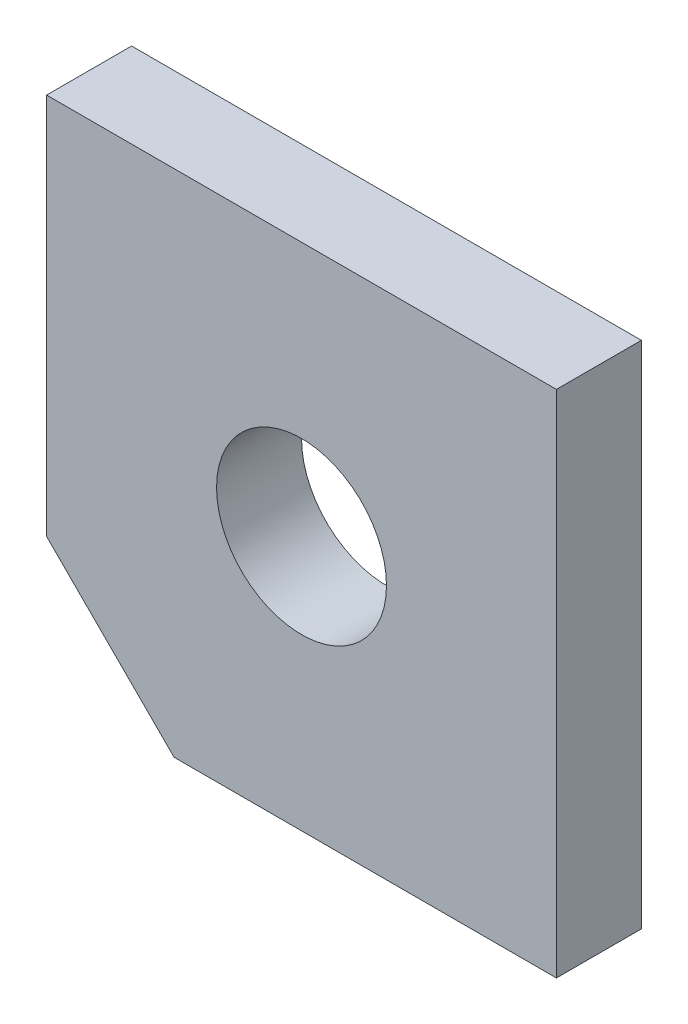
ISO-10303-21;
HEADER;
FILE_DESCRIPTION(('STEP AP214'),'2;1');
FILE_NAME('part.step','',(''),(''),'','','');
FILE_SCHEMA(('AUTOMOTIVE_DESIGN { 1 0 10303 214 1 1 1 1 }'));
ENDSEC;
DATA;
#1=APPLICATION_CONTEXT('core data for automotive mechanical design processes');
#2=APPLICATION_PROTOCOL_DEFINITION('international standard','automotive_design',2000,#1);
#3=PRODUCT_CONTEXT('',#1,'mechanical');
#4=PRODUCT('Part','Part','',(#3));
#5=PRODUCT_RELATED_PRODUCT_CATEGORY('part','',(#4));
#6=PRODUCT_DEFINITION_FORMATION('','',#4);
#7=PRODUCT_DEFINITION_CONTEXT('part definition',#1,'design');
#8=PRODUCT_DEFINITION('design','',#6,#7);
#9=PRODUCT_DEFINITION_SHAPE('','',#8);
#10=(LENGTH_UNIT() NAMED_UNIT(*) SI_UNIT(.MILLI.,.METRE.));
#11=(NAMED_UNIT(*) PLANE_ANGLE_UNIT() SI_UNIT($,.RADIAN.));
#12=(NAMED_UNIT(*) SI_UNIT($,.STERADIAN.) SOLID_ANGLE_UNIT());
#13=UNCERTAINTY_MEASURE_WITH_UNIT(LENGTH_MEASURE(1.E-05),#10,'distance_accuracy_value','');
#14=(GEOMETRIC_REPRESENTATION_CONTEXT(3) GLOBAL_UNCERTAINTY_ASSIGNED_CONTEXT((#13)) GLOBAL_UNIT_ASSIGNED_CONTEXT((#10,
#11,#12)) REPRESENTATION_CONTEXT('',''));
#15=CARTESIAN_POINT('',(0.,0.,0.));
#16=DIRECTION('',(0.,0.,1.));
#17=DIRECTION('',(1.,0.,0.));
#18=AXIS2_PLACEMENT_3D('',#15,#16,#17);
#19=CARTESIAN_POINT('',(0.,76.2,12.7));
#20=DIRECTION('',(0.,0.,1.));
#21=DIRECTION('',(1.,0.,0.));
#22=AXIS2_PLACEMENT_3D('',#19,#20,#21);
#23=PLANE('',#22);
#24=DIRECTION('',(0.,-1.,0.));
#25=VECTOR('',#24,1.);
#26=CARTESIAN_POINT('',(-76.2,0.,12.7));
#27=LINE('',#26,#25);
#28=CARTESIAN_POINT('',(-76.2,76.2,12.7));
#29=VERTEX_POINT('',#28);
#30=CARTESIAN_POINT('',(-76.2,19.0500000000001,12.7));
#31=VERTEX_POINT('',#30);
#32=EDGE_CURVE('E90',#29,#31,#27,.T.);
#33=ORIENTED_EDGE('',*,*,#32,.T.);
#34=DIRECTION('',(-0.707106781186546,0.707106781186549,0.));
#35=VECTOR('',#34,1.);
#36=CARTESIAN_POINT('',(-66.6750000000001,9.52500000000014,12.7));
#37=LINE('',#36,#35);
#38=CARTESIAN_POINT('',(-57.15,0.,12.7));
#39=VERTEX_POINT('',#38);
#40=EDGE_CURVE('E11',#31,#39,#37,.F.);
#41=ORIENTED_EDGE('',*,*,#40,.T.);
#42=DIRECTION('',(1.,0.,0.));
#43=VECTOR('',#42,1.);
#44=CARTESIAN_POINT('',(0.,0.,12.7));
#45=LINE('',#44,#43);
#46=CARTESIAN_POINT('',(0.,0.,12.7));
#47=VERTEX_POINT('',#46);
#48=EDGE_CURVE('E96',#39,#47,#45,.T.);
#49=ORIENTED_EDGE('',*,*,#48,.T.);
#50=DIRECTION('',(0.,1.,0.));
#51=VECTOR('',#50,1.);
#52=CARTESIAN_POINT('',(0.,0.,12.7));
#53=LINE('',#52,#51);
#54=CARTESIAN_POINT('',(0.,76.2,12.7));
#55=VERTEX_POINT('',#54);
#56=EDGE_CURVE('E91',#47,#55,#53,.T.);
#57=ORIENTED_EDGE('',*,*,#56,.T.);
#58=DIRECTION('',(-1.,0.,0.));
#59=VECTOR('',#58,1.);
#60=CARTESIAN_POINT('',(0.,76.2,12.7));
#61=LINE('',#60,#59);
#62=EDGE_CURVE('E81',#55,#29,#61,.T.);
#63=ORIENTED_EDGE('',*,*,#62,.T.);
#64=EDGE_LOOP('',(#33,#41,#49,#57,#63));
#65=FACE_BOUND('',#64,.T.);
#66=CARTESIAN_POINT('',(-38.1,38.1,12.7));
#67=DIRECTION('',(0.,0.,1.));
#68=DIRECTION('',(1.,0.,0.));
#69=AXIS2_PLACEMENT_3D('',#66,#67,#68);
#70=CIRCLE('',#69,12.7);
#71=CARTESIAN_POINT('',(-25.4,38.1,12.7));
#72=VERTEX_POINT('',#71);
#73=EDGE_CURVE('E120',#72,#72,#70,.T.);
#74=ORIENTED_EDGE('',*,*,#73,.F.);
#75=EDGE_LOOP('',(#74));
#76=FACE_BOUND('',#75,.T.);
#77=ADVANCED_FACE('F34',(#65,#76),#23,.T.);
#78=CARTESIAN_POINT('',(0.,76.2,0.));
#79=DIRECTION('',(0.,0.,1.));
#80=DIRECTION('',(1.,0.,0.));
#81=AXIS2_PLACEMENT_3D('',#78,#79,#80);
#82=PLANE('',#81);
#83=DIRECTION('',(1.,0.,0.));
#84=VECTOR('',#83,1.);
#85=CARTESIAN_POINT('',(0.,0.,0.));
#86=LINE('',#85,#84);
#87=CARTESIAN_POINT('',(-57.15,0.,0.));
#88=VERTEX_POINT('',#87);
#89=CARTESIAN_POINT('',(0.,0.,0.));
#90=VERTEX_POINT('',#89);
#91=EDGE_CURVE('E100',#88,#90,#86,.T.);
#92=ORIENTED_EDGE('',*,*,#91,.F.);
#93=DIRECTION('',(0.707106781186546,-0.707106781186549,0.));
#94=VECTOR('',#93,1.);
#95=CARTESIAN_POINT('',(-57.15,0.,0.));
#96=LINE('',#95,#94);
#97=CARTESIAN_POINT('',(-76.2,19.0500000000001,0.));
#98=VERTEX_POINT('',#97);
#99=EDGE_CURVE('E56',#88,#98,#96,.F.);
#100=ORIENTED_EDGE('',*,*,#99,.T.);
#101=DIRECTION('',(0.,-1.,0.));
#102=VECTOR('',#101,1.);
#103=CARTESIAN_POINT('',(-76.2,0.,0.));
#104=LINE('',#103,#102);
#105=CARTESIAN_POINT('',(-76.2,76.2,0.));
#106=VERTEX_POINT('',#105);
#107=EDGE_CURVE('E115',#106,#98,#104,.T.);
#108=ORIENTED_EDGE('',*,*,#107,.F.);
#109=DIRECTION('',(-1.,0.,0.));
#110=VECTOR('',#109,1.);
#111=CARTESIAN_POINT('',(0.,76.2,0.));
#112=LINE('',#111,#110);
#113=CARTESIAN_POINT('',(0.,76.2,0.));
#114=VERTEX_POINT('',#113);
#115=EDGE_CURVE('E117',#114,#106,#112,.T.);
#116=ORIENTED_EDGE('',*,*,#115,.F.);
#117=DIRECTION('',(0.,1.,0.));
#118=VECTOR('',#117,1.);
#119=CARTESIAN_POINT('',(0.,0.,0.));
#120=LINE('',#119,#118);
#121=EDGE_CURVE('E104',#90,#114,#120,.T.);
#122=ORIENTED_EDGE('',*,*,#121,.F.);
#123=EDGE_LOOP('',(#92,#100,#108,#116,#122));
#124=FACE_BOUND('',#123,.T.);
#125=CARTESIAN_POINT('',(-38.1,38.1,0.));
#126=DIRECTION('',(0.,0.,1.));
#127=DIRECTION('',(1.,0.,0.));
#128=AXIS2_PLACEMENT_3D('',#125,#126,#127);
#129=CIRCLE('',#128,12.7);
#130=CARTESIAN_POINT('',(-25.4,38.1,0.));
#131=VERTEX_POINT('',#130);
#132=EDGE_CURVE('E123',#131,#131,#129,.T.);
#133=ORIENTED_EDGE('',*,*,#132,.T.);
#134=EDGE_LOOP('',(#133));
#135=FACE_BOUND('',#134,.T.);
#136=ADVANCED_FACE('F132',(#124,#135),#82,.F.);
#137=CARTESIAN_POINT('',(0.,0.,12.7));
#138=DIRECTION('',(-1.,0.,0.));
#139=DIRECTION('',(0.,0.,1.));
#140=AXIS2_PLACEMENT_3D('',#137,#138,#139);
#141=PLANE('',#140);
#142=ORIENTED_EDGE('',*,*,#121,.T.);
#143=DIRECTION('',(0.,0.,-1.));
#144=VECTOR('',#143,1.);
#145=CARTESIAN_POINT('',(0.,76.2,12.7));
#146=LINE('',#145,#144);
#147=EDGE_CURVE('E85',#55,#114,#146,.T.);
#148=ORIENTED_EDGE('',*,*,#147,.F.);
#149=ORIENTED_EDGE('',*,*,#56,.F.);
#150=DIRECTION('',(0.,0.,-1.));
#151=VECTOR('',#150,1.);
#152=CARTESIAN_POINT('',(0.,0.,12.7));
#153=LINE('',#152,#151);
#154=EDGE_CURVE('E109',#47,#90,#153,.T.);
#155=ORIENTED_EDGE('',*,*,#154,.T.);
#156=EDGE_LOOP('',(#142,#148,#149,#155));
#157=FACE_BOUND('',#156,.T.);
#158=ADVANCED_FACE('F102',(#157),#141,.F.);
#159=CARTESIAN_POINT('',(0.,76.2,12.7));
#160=DIRECTION('',(0.,-1.,0.));
#161=DIRECTION('',(0.,0.,-1.));
#162=AXIS2_PLACEMENT_3D('',#159,#160,#161);
#163=PLANE('',#162);
#164=ORIENTED_EDGE('',*,*,#115,.T.);
#165=DIRECTION('',(0.,0.,-1.));
#166=VECTOR('',#165,1.);
#167=CARTESIAN_POINT('',(-76.2,76.2,12.7));
#168=LINE('',#167,#166);
#169=EDGE_CURVE('E88',#29,#106,#168,.T.);
#170=ORIENTED_EDGE('',*,*,#169,.F.);
#171=ORIENTED_EDGE('',*,*,#62,.F.);
#172=ORIENTED_EDGE('',*,*,#147,.T.);
#173=EDGE_LOOP('',(#164,#170,#171,#172));
#174=FACE_BOUND('',#173,.T.);
#175=ADVANCED_FACE('F83',(#174),#163,.F.);
#176=CARTESIAN_POINT('',(-76.2,0.,12.7));
#177=DIRECTION('',(1.,0.,0.));
#178=DIRECTION('',(0.,1.,0.));
#179=AXIS2_PLACEMENT_3D('',#176,#177,#178);
#180=PLANE('',#179);
#181=ORIENTED_EDGE('',*,*,#107,.T.);
#182=DIRECTION('',(0.,0.,1.));
#183=VECTOR('',#182,1.);
#184=CARTESIAN_POINT('',(-76.2,19.0500000000001,12.7));
#185=LINE('',#184,#183);
#186=EDGE_CURVE('E42',#98,#31,#185,.T.);
#187=ORIENTED_EDGE('',*,*,#186,.T.);
#188=ORIENTED_EDGE('',*,*,#32,.F.);
#189=ORIENTED_EDGE('',*,*,#169,.T.);
#190=EDGE_LOOP('',(#181,#187,#188,#189));
#191=FACE_BOUND('',#190,.T.);
#192=ADVANCED_FACE('F143',(#191),#180,.F.);
#193=CARTESIAN_POINT('',(0.,0.,12.7));
#194=DIRECTION('',(0.,1.,0.));
#195=DIRECTION('',(-1.,0.,0.));
#196=AXIS2_PLACEMENT_3D('',#193,#194,#195);
#197=PLANE('',#196);
#198=ORIENTED_EDGE('',*,*,#48,.F.);
#199=DIRECTION('',(0.,0.,-1.));
#200=VECTOR('',#199,1.);
#201=CARTESIAN_POINT('',(-57.15,0.,12.7));
#202=LINE('',#201,#200);
#203=EDGE_CURVE('E105',#39,#88,#202,.T.);
#204=ORIENTED_EDGE('',*,*,#203,.T.);
#205=ORIENTED_EDGE('',*,*,#91,.T.);
#206=ORIENTED_EDGE('',*,*,#154,.F.);
#207=EDGE_LOOP('',(#198,#204,#205,#206));
#208=FACE_BOUND('',#207,.T.);
#209=ADVANCED_FACE('F140',(#208),#197,.F.);
#210=CARTESIAN_POINT('',(-38.1,38.1,12.7));
#211=DIRECTION('',(0.,0.,-1.));
#212=DIRECTION('',(-1.,0.,0.));
#213=AXIS2_PLACEMENT_3D('',#210,#211,#212);
#214=CYLINDRICAL_SURFACE('',#213,12.7);
#215=ORIENTED_EDGE('',*,*,#73,.T.);
#216=EDGE_LOOP('',(#215));
#217=FACE_BOUND('',#216,.T.);
#218=ORIENTED_EDGE('',*,*,#132,.F.);
#219=EDGE_LOOP('',(#218));
#220=FACE_BOUND('',#219,.T.);
#221=ADVANCED_FACE('F129',(#217,#220),#214,.F.);
#222=CARTESIAN_POINT('',(-57.15,0.,12.7));
#223=DIRECTION('',(0.707106781186549,0.707106781186546,0.));
#224=DIRECTION('',(-0.707106781186546,0.707106781186549,0.));
#225=AXIS2_PLACEMENT_3D('',#222,#223,#224);
#226=PLANE('',#225);
#227=ORIENTED_EDGE('',*,*,#40,.F.);
#228=ORIENTED_EDGE('',*,*,#186,.F.);
#229=ORIENTED_EDGE('',*,*,#99,.F.);
#230=ORIENTED_EDGE('',*,*,#203,.F.);
#231=EDGE_LOOP('',(#227,#228,#229,#230));
#232=FACE_BOUND('',#231,.T.);
#233=ADVANCED_FACE('F36',(#232),#226,.F.);
#234=CLOSED_SHELL('',(#77,#136,#158,#175,#192,#209,#221,#233));
#235=MANIFOLD_SOLID_BREP('B2',#234);
#236=ADVANCED_BREP_SHAPE_REPRESENTATION('',(#18,#235),#14);
#237=SHAPE_DEFINITION_REPRESENTATION(#9,#236);
ENDSEC;
END-ISO-10303-21;
